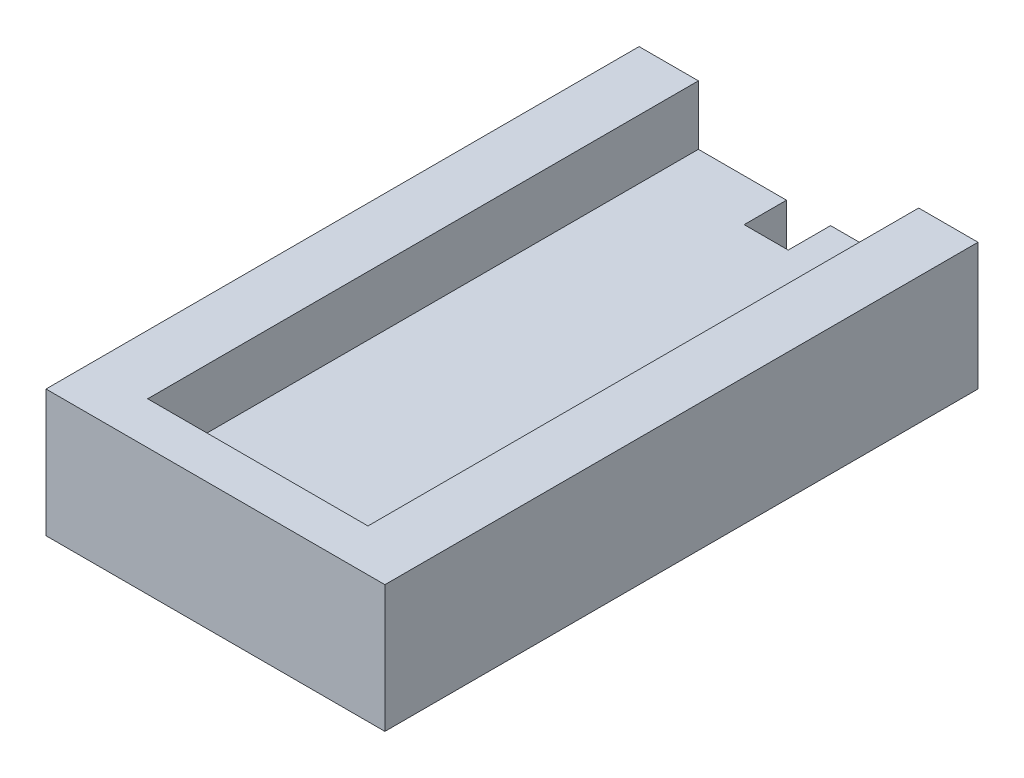
ISO-10303-21;
HEADER;
FILE_DESCRIPTION(('STEP AP214'),'2;1');
FILE_NAME('part.step','',(''),(''),'','','');
FILE_SCHEMA(('AUTOMOTIVE_DESIGN { 1 0 10303 214 1 1 1 1 }'));
ENDSEC;
DATA;
#1=APPLICATION_CONTEXT('core data for automotive mechanical design processes');
#2=APPLICATION_PROTOCOL_DEFINITION('international standard','automotive_design',2000,#1);
#3=PRODUCT_CONTEXT('',#1,'mechanical');
#4=PRODUCT('Part','Part','',(#3));
#5=PRODUCT_RELATED_PRODUCT_CATEGORY('part','',(#4));
#6=PRODUCT_DEFINITION_FORMATION('','',#4);
#7=PRODUCT_DEFINITION_CONTEXT('part definition',#1,'design');
#8=PRODUCT_DEFINITION('design','',#6,#7);
#9=PRODUCT_DEFINITION_SHAPE('','',#8);
#10=(LENGTH_UNIT() NAMED_UNIT(*) SI_UNIT(.MILLI.,.METRE.));
#11=(NAMED_UNIT(*) PLANE_ANGLE_UNIT() SI_UNIT($,.RADIAN.));
#12=(NAMED_UNIT(*) SI_UNIT($,.STERADIAN.) SOLID_ANGLE_UNIT());
#13=UNCERTAINTY_MEASURE_WITH_UNIT(LENGTH_MEASURE(1.E-05),#10,'distance_accuracy_value','');
#14=(GEOMETRIC_REPRESENTATION_CONTEXT(3) GLOBAL_UNCERTAINTY_ASSIGNED_CONTEXT((#13)) GLOBAL_UNIT_ASSIGNED_CONTEXT((#10,
#11,#12)) REPRESENTATION_CONTEXT('',''));
#15=CARTESIAN_POINT('',(0.,0.,0.));
#16=DIRECTION('',(0.,0.,1.));
#17=DIRECTION('',(1.,0.,0.));
#18=AXIS2_PLACEMENT_3D('',#15,#16,#17);
#19=CARTESIAN_POINT('',(0.,0.,0.));
#20=DIRECTION('',(0.,-1.,0.));
#21=DIRECTION('',(1.,0.,0.));
#22=AXIS2_PLACEMENT_3D('',#19,#20,#21);
#23=PLANE('',#22);
#24=DIRECTION('',(0.,0.,1.));
#25=VECTOR('',#24,1.);
#26=CARTESIAN_POINT('',(20.,0.,70.));
#27=LINE('',#26,#25);
#28=CARTESIAN_POINT('',(20.,0.,0.));
#29=VERTEX_POINT('',#28);
#30=CARTESIAN_POINT('',(20.,0.,70.));
#31=VERTEX_POINT('',#30);
#32=EDGE_CURVE('E223',#29,#31,#27,.T.);
#33=ORIENTED_EDGE('',*,*,#32,.F.);
#34=DIRECTION('',(1.,0.,0.));
#35=VECTOR('',#34,1.);
#36=CARTESIAN_POINT('',(0.,0.,0.));
#37=LINE('',#36,#35);
#38=CARTESIAN_POINT('',(13.,0.,0.));
#39=VERTEX_POINT('',#38);
#40=EDGE_CURVE('E215',#39,#29,#37,.T.);
#41=ORIENTED_EDGE('',*,*,#40,.F.);
#42=DIRECTION('',(0.,0.,-1.));
#43=VECTOR('',#42,1.);
#44=CARTESIAN_POINT('',(13.,0.,65.));
#45=LINE('',#44,#43);
#46=CARTESIAN_POINT('',(13.,0.,65.));
#47=VERTEX_POINT('',#46);
#48=EDGE_CURVE('E48',#47,#39,#45,.T.);
#49=ORIENTED_EDGE('',*,*,#48,.F.);
#50=DIRECTION('',(1.,0.,0.));
#51=VECTOR('',#50,1.);
#52=CARTESIAN_POINT('',(0.,0.,65.));
#53=LINE('',#52,#51);
#54=CARTESIAN_POINT('',(-13.,0.,65.));
#55=VERTEX_POINT('',#54);
#56=EDGE_CURVE('E12',#55,#47,#53,.T.);
#57=ORIENTED_EDGE('',*,*,#56,.F.);
#58=DIRECTION('',(0.,0.,1.));
#59=VECTOR('',#58,1.);
#60=CARTESIAN_POINT('',(-13.,0.,65.));
#61=LINE('',#60,#59);
#62=CARTESIAN_POINT('',(-13.,0.,0.));
#63=VERTEX_POINT('',#62);
#64=EDGE_CURVE('E120',#63,#55,#61,.T.);
#65=ORIENTED_EDGE('',*,*,#64,.F.);
#66=DIRECTION('',(1.,0.,0.));
#67=VECTOR('',#66,1.);
#68=CARTESIAN_POINT('',(0.,0.,0.));
#69=LINE('',#68,#67);
#70=CARTESIAN_POINT('',(-20.,0.,0.));
#71=VERTEX_POINT('',#70);
#72=EDGE_CURVE('E211',#71,#63,#69,.T.);
#73=ORIENTED_EDGE('',*,*,#72,.F.);
#74=DIRECTION('',(0.,0.,-1.));
#75=VECTOR('',#74,1.);
#76=CARTESIAN_POINT('',(-20.,0.,70.));
#77=LINE('',#76,#75);
#78=CARTESIAN_POINT('',(-20.,0.,70.));
#79=VERTEX_POINT('',#78);
#80=EDGE_CURVE('E213',#79,#71,#77,.T.);
#81=ORIENTED_EDGE('',*,*,#80,.F.);
#82=DIRECTION('',(1.,0.,0.));
#83=VECTOR('',#82,1.);
#84=CARTESIAN_POINT('',(0.,0.,70.));
#85=LINE('',#84,#83);
#86=EDGE_CURVE('E221',#79,#31,#85,.T.);
#87=ORIENTED_EDGE('',*,*,#86,.T.);
#88=EDGE_LOOP('',(#33,#41,#49,#57,#65,#73,#81,#87));
#89=FACE_BOUND('',#88,.T.);
#90=ADVANCED_FACE('F33',(#89),#23,.F.);
#91=CARTESIAN_POINT('',(0.,0.,0.));
#92=DIRECTION('',(0.,0.,1.));
#93=DIRECTION('',(1.,0.,0.));
#94=AXIS2_PLACEMENT_3D('',#91,#92,#93);
#95=PLANE('',#94);
#96=DIRECTION('',(0.,-1.,0.));
#97=VECTOR('',#96,1.);
#98=CARTESIAN_POINT('',(13.,7.,0.));
#99=LINE('',#98,#97);
#100=CARTESIAN_POINT('',(13.,-7.,0.));
#101=VERTEX_POINT('',#100);
#102=EDGE_CURVE('E147',#39,#101,#99,.T.);
#103=ORIENTED_EDGE('',*,*,#102,.F.);
#104=ORIENTED_EDGE('',*,*,#40,.T.);
#105=DIRECTION('',(0.,1.,0.));
#106=VECTOR('',#105,1.);
#107=CARTESIAN_POINT('',(20.,15.,0.));
#108=LINE('',#107,#106);
#109=CARTESIAN_POINT('',(20.,-15.,0.));
#110=VERTEX_POINT('',#109);
#111=EDGE_CURVE('E155',#110,#29,#108,.T.);
#112=ORIENTED_EDGE('',*,*,#111,.F.);
#113=DIRECTION('',(1.,0.,0.));
#114=VECTOR('',#113,1.);
#115=CARTESIAN_POINT('',(-20.,-15.,0.));
#116=LINE('',#115,#114);
#117=CARTESIAN_POINT('',(2.6,-15.,0.));
#118=VERTEX_POINT('',#117);
#119=EDGE_CURVE('E170',#118,#110,#116,.T.);
#120=ORIENTED_EDGE('',*,*,#119,.F.);
#121=DIRECTION('',(0.,1.,0.));
#122=VECTOR('',#121,1.);
#123=CARTESIAN_POINT('',(2.6,-17.,0.));
#124=LINE('',#123,#122);
#125=CARTESIAN_POINT('',(2.6,-7.,0.));
#126=VERTEX_POINT('',#125);
#127=EDGE_CURVE('E190',#118,#126,#124,.T.);
#128=ORIENTED_EDGE('',*,*,#127,.T.);
#129=DIRECTION('',(-1.,0.,0.));
#130=VECTOR('',#129,1.);
#131=CARTESIAN_POINT('',(-13.,-7.,0.));
#132=LINE('',#131,#130);
#133=EDGE_CURVE('E151',#101,#126,#132,.T.);
#134=ORIENTED_EDGE('',*,*,#133,.F.);
#135=EDGE_LOOP('',(#103,#104,#112,#120,#128,#134));
#136=FACE_BOUND('',#135,.T.);
#137=ADVANCED_FACE('F240',(#136),#95,.F.);
#138=CARTESIAN_POINT('',(20.,15.,70.));
#139=DIRECTION('',(-1.,0.,0.));
#140=DIRECTION('',(0.,0.,1.));
#141=AXIS2_PLACEMENT_3D('',#138,#139,#140);
#142=PLANE('',#141);
#143=ORIENTED_EDGE('',*,*,#111,.T.);
#144=ORIENTED_EDGE('',*,*,#32,.T.);
#145=DIRECTION('',(0.,1.,0.));
#146=VECTOR('',#145,1.);
#147=CARTESIAN_POINT('',(20.,15.,70.));
#148=LINE('',#147,#146);
#149=CARTESIAN_POINT('',(20.,-15.,70.));
#150=VERTEX_POINT('',#149);
#151=EDGE_CURVE('E157',#150,#31,#148,.T.);
#152=ORIENTED_EDGE('',*,*,#151,.F.);
#153=DIRECTION('',(0.,0.,-1.));
#154=VECTOR('',#153,1.);
#155=CARTESIAN_POINT('',(20.,-15.,70.));
#156=LINE('',#155,#154);
#157=EDGE_CURVE('E165',#150,#110,#156,.T.);
#158=ORIENTED_EDGE('',*,*,#157,.T.);
#159=EDGE_LOOP('',(#143,#144,#152,#158));
#160=FACE_BOUND('',#159,.T.);
#161=ADVANCED_FACE('F35',(#160),#142,.F.);
#162=CARTESIAN_POINT('',(-20.,15.,70.));
#163=DIRECTION('',(1.,0.,0.));
#164=DIRECTION('',(0.,1.,0.));
#165=AXIS2_PLACEMENT_3D('',#162,#163,#164);
#166=PLANE('',#165);
#167=DIRECTION('',(0.,-1.,0.));
#168=VECTOR('',#167,1.);
#169=CARTESIAN_POINT('',(-20.,15.,70.));
#170=LINE('',#169,#168);
#171=CARTESIAN_POINT('',(-20.,-15.,70.));
#172=VERTEX_POINT('',#171);
#173=EDGE_CURVE('E160',#79,#172,#170,.T.);
#174=ORIENTED_EDGE('',*,*,#173,.F.);
#175=ORIENTED_EDGE('',*,*,#80,.T.);
#176=DIRECTION('',(0.,-1.,0.));
#177=VECTOR('',#176,1.);
#178=CARTESIAN_POINT('',(-20.,15.,0.));
#179=LINE('',#178,#177);
#180=CARTESIAN_POINT('',(-20.,-15.,0.));
#181=VERTEX_POINT('',#180);
#182=EDGE_CURVE('E168',#71,#181,#179,.T.);
#183=ORIENTED_EDGE('',*,*,#182,.T.);
#184=DIRECTION('',(0.,0.,-1.));
#185=VECTOR('',#184,1.);
#186=CARTESIAN_POINT('',(-20.,-15.,70.));
#187=LINE('',#186,#185);
#188=EDGE_CURVE('E41',#172,#181,#187,.T.);
#189=ORIENTED_EDGE('',*,*,#188,.F.);
#190=EDGE_LOOP('',(#174,#175,#183,#189));
#191=FACE_BOUND('',#190,.T.);
#192=ADVANCED_FACE('F260',(#191),#166,.F.);
#193=CARTESIAN_POINT('',(-20.,-15.,70.));
#194=DIRECTION('',(0.,1.,0.));
#195=DIRECTION('',(-1.,0.,0.));
#196=AXIS2_PLACEMENT_3D('',#193,#194,#195);
#197=PLANE('',#196);
#198=DIRECTION('',(1.,0.,0.));
#199=VECTOR('',#198,1.);
#200=CARTESIAN_POINT('',(-20.,-15.,5.));
#201=LINE('',#200,#199);
#202=CARTESIAN_POINT('',(-2.6,-15.,5.));
#203=VERTEX_POINT('',#202);
#204=CARTESIAN_POINT('',(2.6,-15.,5.));
#205=VERTEX_POINT('',#204);
#206=EDGE_CURVE('E201',#203,#205,#201,.T.);
#207=ORIENTED_EDGE('',*,*,#206,.T.);
#208=DIRECTION('',(0.,0.,-1.));
#209=VECTOR('',#208,1.);
#210=CARTESIAN_POINT('',(2.60000000000001,-15.,70.));
#211=LINE('',#210,#209);
#212=EDGE_CURVE('E150',#205,#118,#211,.T.);
#213=ORIENTED_EDGE('',*,*,#212,.T.);
#214=ORIENTED_EDGE('',*,*,#119,.T.);
#215=ORIENTED_EDGE('',*,*,#157,.F.);
#216=DIRECTION('',(1.,0.,0.));
#217=VECTOR('',#216,1.);
#218=CARTESIAN_POINT('',(-20.,-15.,70.));
#219=LINE('',#218,#217);
#220=EDGE_CURVE('E163',#172,#150,#219,.T.);
#221=ORIENTED_EDGE('',*,*,#220,.F.);
#222=ORIENTED_EDGE('',*,*,#188,.T.);
#223=CARTESIAN_POINT('',(-2.6,-15.,0.));
#224=VERTEX_POINT('',#223);
#225=EDGE_CURVE('E161',#181,#224,#116,.T.);
#226=ORIENTED_EDGE('',*,*,#225,.T.);
#227=DIRECTION('',(0.,0.,1.));
#228=VECTOR('',#227,1.);
#229=CARTESIAN_POINT('',(-2.59999999999999,-15.,70.));
#230=LINE('',#229,#228);
#231=EDGE_CURVE('E199',#224,#203,#230,.T.);
#232=ORIENTED_EDGE('',*,*,#231,.T.);
#233=EDGE_LOOP('',(#207,#213,#214,#215,#221,#222,#226,#232));
#234=FACE_BOUND('',#233,.T.);
#235=ADVANCED_FACE('F180',(#234),#197,.F.);
#236=CARTESIAN_POINT('',(0.,0.,70.));
#237=DIRECTION('',(0.,0.,1.));
#238=DIRECTION('',(1.,0.,0.));
#239=AXIS2_PLACEMENT_3D('',#236,#237,#238);
#240=PLANE('',#239);
#241=ORIENTED_EDGE('',*,*,#86,.F.);
#242=ORIENTED_EDGE('',*,*,#173,.T.);
#243=ORIENTED_EDGE('',*,*,#220,.T.);
#244=ORIENTED_EDGE('',*,*,#151,.T.);
#245=EDGE_LOOP('',(#241,#242,#243,#244));
#246=FACE_BOUND('',#245,.T.);
#247=ADVANCED_FACE('F265',(#246),#240,.T.);
#248=ORIENTED_EDGE('',*,*,#182,.F.);
#249=ORIENTED_EDGE('',*,*,#72,.T.);
#250=DIRECTION('',(0.,1.,0.));
#251=VECTOR('',#250,1.);
#252=CARTESIAN_POINT('',(-13.,7.,0.));
#253=LINE('',#252,#251);
#254=CARTESIAN_POINT('',(-13.,-7.,0.));
#255=VERTEX_POINT('',#254);
#256=EDGE_CURVE('E133',#255,#63,#253,.T.);
#257=ORIENTED_EDGE('',*,*,#256,.F.);
#258=CARTESIAN_POINT('',(-2.6,-7.,0.));
#259=VERTEX_POINT('',#258);
#260=EDGE_CURVE('E149',#259,#255,#132,.T.);
#261=ORIENTED_EDGE('',*,*,#260,.F.);
#262=DIRECTION('',(0.,1.,0.));
#263=VECTOR('',#262,1.);
#264=CARTESIAN_POINT('',(-2.6,-17.,0.));
#265=LINE('',#264,#263);
#266=EDGE_CURVE('E55',#224,#259,#265,.T.);
#267=ORIENTED_EDGE('',*,*,#266,.F.);
#268=ORIENTED_EDGE('',*,*,#225,.F.);
#269=EDGE_LOOP('',(#248,#249,#257,#261,#267,#268));
#270=FACE_BOUND('',#269,.T.);
#271=ADVANCED_FACE('F187',(#270),#95,.F.);
#272=CARTESIAN_POINT('',(13.,7.,65.));
#273=DIRECTION('',(1.,0.,0.));
#274=DIRECTION('',(0.,1.,0.));
#275=AXIS2_PLACEMENT_3D('',#272,#273,#274);
#276=PLANE('',#275);
#277=DIRECTION('',(0.,-1.,0.));
#278=VECTOR('',#277,1.);
#279=CARTESIAN_POINT('',(13.,7.,65.));
#280=LINE('',#279,#278);
#281=CARTESIAN_POINT('',(13.,-7.,65.));
#282=VERTEX_POINT('',#281);
#283=EDGE_CURVE('E143',#47,#282,#280,.T.);
#284=ORIENTED_EDGE('',*,*,#283,.F.);
#285=ORIENTED_EDGE('',*,*,#48,.T.);
#286=ORIENTED_EDGE('',*,*,#102,.T.);
#287=DIRECTION('',(0.,0.,-1.));
#288=VECTOR('',#287,1.);
#289=CARTESIAN_POINT('',(13.,-7.,65.));
#290=LINE('',#289,#288);
#291=EDGE_CURVE('E138',#282,#101,#290,.T.);
#292=ORIENTED_EDGE('',*,*,#291,.F.);
#293=EDGE_LOOP('',(#284,#285,#286,#292));
#294=FACE_BOUND('',#293,.T.);
#295=ADVANCED_FACE('F206',(#294),#276,.F.);
#296=CARTESIAN_POINT('',(-13.,7.,65.));
#297=DIRECTION('',(-1.,0.,0.));
#298=DIRECTION('',(0.,-1.,0.));
#299=AXIS2_PLACEMENT_3D('',#296,#297,#298);
#300=PLANE('',#299);
#301=ORIENTED_EDGE('',*,*,#256,.T.);
#302=ORIENTED_EDGE('',*,*,#64,.T.);
#303=DIRECTION('',(0.,1.,0.));
#304=VECTOR('',#303,1.);
#305=CARTESIAN_POINT('',(-13.,7.,65.));
#306=LINE('',#305,#304);
#307=CARTESIAN_POINT('',(-13.,-7.,65.));
#308=VERTEX_POINT('',#307);
#309=EDGE_CURVE('E130',#308,#55,#306,.T.);
#310=ORIENTED_EDGE('',*,*,#309,.F.);
#311=DIRECTION('',(0.,0.,-1.));
#312=VECTOR('',#311,1.);
#313=CARTESIAN_POINT('',(-13.,-7.,65.));
#314=LINE('',#313,#312);
#315=EDGE_CURVE('E141',#308,#255,#314,.T.);
#316=ORIENTED_EDGE('',*,*,#315,.T.);
#317=EDGE_LOOP('',(#301,#302,#310,#316));
#318=FACE_BOUND('',#317,.T.);
#319=ADVANCED_FACE('F128',(#318),#300,.F.);
#320=CARTESIAN_POINT('',(-13.,-7.,65.));
#321=DIRECTION('',(0.,-1.,0.));
#322=DIRECTION('',(1.,0.,0.));
#323=AXIS2_PLACEMENT_3D('',#320,#321,#322);
#324=PLANE('',#323);
#325=ORIENTED_EDGE('',*,*,#133,.T.);
#326=DIRECTION('',(0.,0.,-1.));
#327=VECTOR('',#326,1.);
#328=CARTESIAN_POINT('',(2.6,-7.,0.));
#329=LINE('',#328,#327);
#330=CARTESIAN_POINT('',(2.6,-7.,5.));
#331=VERTEX_POINT('',#330);
#332=EDGE_CURVE('E226',#331,#126,#329,.T.);
#333=ORIENTED_EDGE('',*,*,#332,.F.);
#334=DIRECTION('',(1.,0.,0.));
#335=VECTOR('',#334,1.);
#336=CARTESIAN_POINT('',(2.6,-7.,5.));
#337=LINE('',#336,#335);
#338=CARTESIAN_POINT('',(-2.6,-7.,5.));
#339=VERTEX_POINT('',#338);
#340=EDGE_CURVE('E195',#339,#331,#337,.T.);
#341=ORIENTED_EDGE('',*,*,#340,.F.);
#342=DIRECTION('',(0.,0.,1.));
#343=VECTOR('',#342,1.);
#344=CARTESIAN_POINT('',(-2.6,-7.,0.));
#345=LINE('',#344,#343);
#346=EDGE_CURVE('E228',#259,#339,#345,.T.);
#347=ORIENTED_EDGE('',*,*,#346,.F.);
#348=ORIENTED_EDGE('',*,*,#260,.T.);
#349=ORIENTED_EDGE('',*,*,#315,.F.);
#350=DIRECTION('',(-1.,0.,0.));
#351=VECTOR('',#350,1.);
#352=CARTESIAN_POINT('',(-13.,-7.,65.));
#353=LINE('',#352,#351);
#354=EDGE_CURVE('E137',#282,#308,#353,.T.);
#355=ORIENTED_EDGE('',*,*,#354,.F.);
#356=ORIENTED_EDGE('',*,*,#291,.T.);
#357=EDGE_LOOP('',(#325,#333,#341,#347,#348,#349,#355,#356));
#358=FACE_BOUND('',#357,.T.);
#359=ADVANCED_FACE('F210',(#358),#324,.F.);
#360=CARTESIAN_POINT('',(0.,0.,65.));
#361=DIRECTION('',(0.,0.,1.));
#362=DIRECTION('',(1.,0.,0.));
#363=AXIS2_PLACEMENT_3D('',#360,#361,#362);
#364=PLANE('',#363);
#365=ORIENTED_EDGE('',*,*,#309,.T.);
#366=ORIENTED_EDGE('',*,*,#56,.T.);
#367=ORIENTED_EDGE('',*,*,#283,.T.);
#368=ORIENTED_EDGE('',*,*,#354,.T.);
#369=EDGE_LOOP('',(#365,#366,#367,#368));
#370=FACE_BOUND('',#369,.T.);
#371=ADVANCED_FACE('F135',(#370),#364,.F.);
#372=CARTESIAN_POINT('',(2.6,-17.,0.));
#373=DIRECTION('',(1.,0.,0.));
#374=DIRECTION('',(0.,0.,-1.));
#375=AXIS2_PLACEMENT_3D('',#372,#373,#374);
#376=PLANE('',#375);
#377=DIRECTION('',(0.,1.,0.));
#378=VECTOR('',#377,1.);
#379=CARTESIAN_POINT('',(2.6,-17.,5.));
#380=LINE('',#379,#378);
#381=EDGE_CURVE('E192',#205,#331,#380,.T.);
#382=ORIENTED_EDGE('',*,*,#381,.T.);
#383=ORIENTED_EDGE('',*,*,#332,.T.);
#384=ORIENTED_EDGE('',*,*,#127,.F.);
#385=ORIENTED_EDGE('',*,*,#212,.F.);
#386=EDGE_LOOP('',(#382,#383,#384,#385));
#387=FACE_BOUND('',#386,.T.);
#388=ADVANCED_FACE('F233',(#387),#376,.F.);
#389=CARTESIAN_POINT('',(2.6,-17.,5.));
#390=DIRECTION('',(0.,0.,1.));
#391=DIRECTION('',(1.,0.,0.));
#392=AXIS2_PLACEMENT_3D('',#389,#390,#391);
#393=PLANE('',#392);
#394=DIRECTION('',(0.,1.,0.));
#395=VECTOR('',#394,1.);
#396=CARTESIAN_POINT('',(-2.6,-17.,5.));
#397=LINE('',#396,#395);
#398=EDGE_CURVE('E189',#203,#339,#397,.T.);
#399=ORIENTED_EDGE('',*,*,#398,.T.);
#400=ORIENTED_EDGE('',*,*,#340,.T.);
#401=ORIENTED_EDGE('',*,*,#381,.F.);
#402=ORIENTED_EDGE('',*,*,#206,.F.);
#403=EDGE_LOOP('',(#399,#400,#401,#402));
#404=FACE_BOUND('',#403,.T.);
#405=ADVANCED_FACE('F237',(#404),#393,.F.);
#406=CARTESIAN_POINT('',(-2.6,-17.,0.));
#407=DIRECTION('',(-1.,0.,0.));
#408=DIRECTION('',(0.,0.,1.));
#409=AXIS2_PLACEMENT_3D('',#406,#407,#408);
#410=PLANE('',#409);
#411=ORIENTED_EDGE('',*,*,#266,.T.);
#412=ORIENTED_EDGE('',*,*,#346,.T.);
#413=ORIENTED_EDGE('',*,*,#398,.F.);
#414=ORIENTED_EDGE('',*,*,#231,.F.);
#415=EDGE_LOOP('',(#411,#412,#413,#414));
#416=FACE_BOUND('',#415,.T.);
#417=ADVANCED_FACE('F243',(#416),#410,.F.);
#418=CLOSED_SHELL('',(#90,#137,#161,#192,#235,#247,#271,#295,#319,#359,#371,#388,#405,#417));
#419=MANIFOLD_SOLID_BREP('B2',#418);
#420=ADVANCED_BREP_SHAPE_REPRESENTATION('',(#18,#419),#14);
#421=SHAPE_DEFINITION_REPRESENTATION(#9,#420);
ENDSEC;
END-ISO-10303-21;
